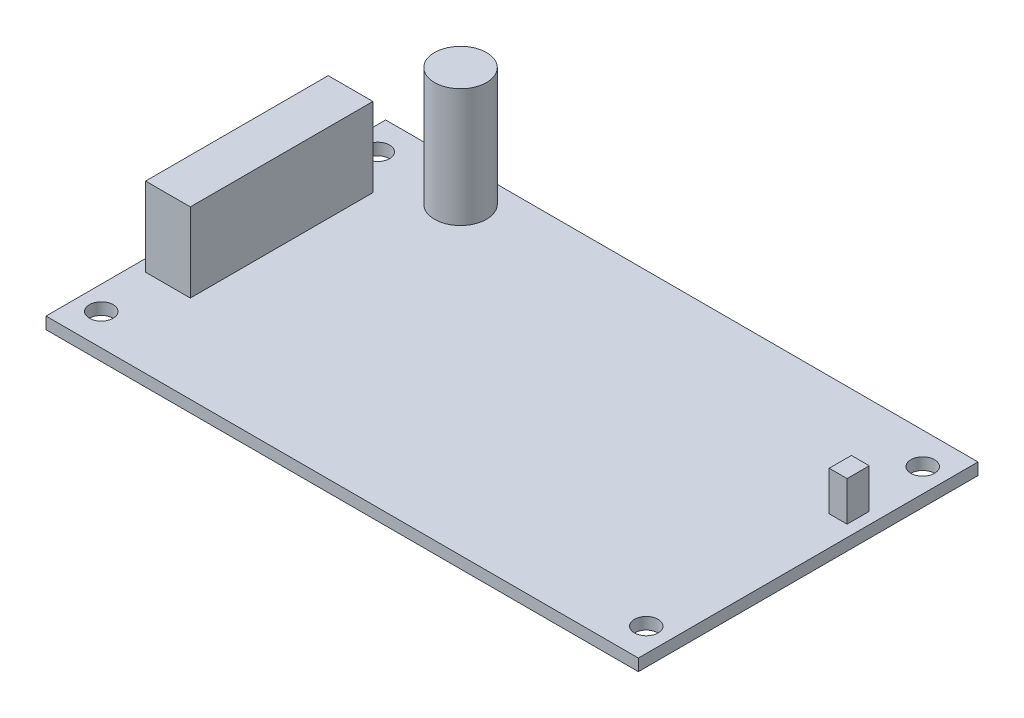
ISO-10303-21;
HEADER;
FILE_DESCRIPTION(('STEP AP214'),'2;1');
FILE_NAME('part.step','',(''),(''),'','','');
FILE_SCHEMA(('AUTOMOTIVE_DESIGN { 1 0 10303 214 1 1 1 1 }'));
ENDSEC;
DATA;
#1=APPLICATION_CONTEXT('core data for automotive mechanical design processes');
#2=APPLICATION_PROTOCOL_DEFINITION('international standard','automotive_design',2000,#1);
#3=PRODUCT_CONTEXT('',#1,'mechanical');
#4=PRODUCT('Part','Part','',(#3));
#5=PRODUCT_RELATED_PRODUCT_CATEGORY('part','',(#4));
#6=PRODUCT_DEFINITION_FORMATION('','',#4);
#7=PRODUCT_DEFINITION_CONTEXT('part definition',#1,'design');
#8=PRODUCT_DEFINITION('design','',#6,#7);
#9=PRODUCT_DEFINITION_SHAPE('','',#8);
#10=(LENGTH_UNIT() NAMED_UNIT(*) SI_UNIT(.MILLI.,.METRE.));
#11=(NAMED_UNIT(*) PLANE_ANGLE_UNIT() SI_UNIT($,.RADIAN.));
#12=(NAMED_UNIT(*) SI_UNIT($,.STERADIAN.) SOLID_ANGLE_UNIT());
#13=UNCERTAINTY_MEASURE_WITH_UNIT(LENGTH_MEASURE(1.E-05),#10,'distance_accuracy_value','');
#14=(GEOMETRIC_REPRESENTATION_CONTEXT(3) GLOBAL_UNCERTAINTY_ASSIGNED_CONTEXT((#13)) GLOBAL_UNIT_ASSIGNED_CONTEXT((#10,
#11,#12)) REPRESENTATION_CONTEXT('',''));
#15=CARTESIAN_POINT('',(0.,0.,0.));
#16=DIRECTION('',(0.,0.,1.));
#17=DIRECTION('',(1.,0.,0.));
#18=AXIS2_PLACEMENT_3D('',#15,#16,#17);
#19=CARTESIAN_POINT('',(0.,1.5,0.));
#20=DIRECTION('',(0.,1.,0.));
#21=DIRECTION('',(0.,0.,1.));
#22=AXIS2_PLACEMENT_3D('',#19,#20,#21);
#23=PLANE('',#22);
#24=CARTESIAN_POINT('',(-23.5051005862928,1.5,-16.9888350772215));
#25=DIRECTION('',(0.,1.,0.));
#26=DIRECTION('',(0.,0.,1.));
#27=AXIS2_PLACEMENT_3D('',#24,#25,#26);
#28=CIRCLE('',#27,3.29212519084606);
#29=CARTESIAN_POINT('',(-23.5051005862928,1.5,-13.6967098863754));
#30=VERTEX_POINT('',#29);
#31=EDGE_CURVE('E392',#30,#30,#28,.T.);
#32=ORIENTED_EDGE('',*,*,#31,.F.);
#33=EDGE_LOOP('',(#32));
#34=FACE_BOUND('',#33,.T.);
#35=CARTESIAN_POINT('',(34.5,1.5,17.5));
#36=DIRECTION('',(0.,1.,0.));
#37=DIRECTION('',(0.,0.,1.));
#38=AXIS2_PLACEMENT_3D('',#35,#36,#37);
#39=CIRCLE('',#38,1.5);
#40=CARTESIAN_POINT('',(34.5,1.5,19.));
#41=VERTEX_POINT('',#40);
#42=EDGE_CURVE('E217',#41,#41,#39,.T.);
#43=ORIENTED_EDGE('',*,*,#42,.F.);
#44=EDGE_LOOP('',(#43));
#45=FACE_BOUND('',#44,.T.);
#46=CARTESIAN_POINT('',(-34.5,1.5,-17.5));
#47=DIRECTION('',(0.,1.,0.));
#48=DIRECTION('',(0.,0.,1.));
#49=AXIS2_PLACEMENT_3D('',#46,#47,#48);
#50=CIRCLE('',#49,1.5);
#51=CARTESIAN_POINT('',(-34.5,1.5,-16.));
#52=VERTEX_POINT('',#51);
#53=EDGE_CURVE('E233',#52,#52,#50,.T.);
#54=ORIENTED_EDGE('',*,*,#53,.F.);
#55=EDGE_LOOP('',(#54));
#56=FACE_BOUND('',#55,.T.);
#57=DIRECTION('',(0.,0.,1.));
#58=VECTOR('',#57,1.);
#59=CARTESIAN_POINT('',(-37.5,1.5,21.5));
#60=LINE('',#59,#58);
#61=CARTESIAN_POINT('',(-37.5,1.5,-21.5));
#62=VERTEX_POINT('',#61);
#63=CARTESIAN_POINT('',(-37.5,1.5,21.5));
#64=VERTEX_POINT('',#63);
#65=EDGE_CURVE('E241',#62,#64,#60,.T.);
#66=ORIENTED_EDGE('',*,*,#65,.T.);
#67=DIRECTION('',(1.,0.,0.));
#68=VECTOR('',#67,1.);
#69=CARTESIAN_POINT('',(37.5,1.5,21.5));
#70=LINE('',#69,#68);
#71=CARTESIAN_POINT('',(37.5,1.5,21.5));
#72=VERTEX_POINT('',#71);
#73=EDGE_CURVE('E245',#64,#72,#70,.T.);
#74=ORIENTED_EDGE('',*,*,#73,.T.);
#75=DIRECTION('',(0.,0.,-1.));
#76=VECTOR('',#75,1.);
#77=CARTESIAN_POINT('',(37.5,1.5,21.5));
#78=LINE('',#77,#76);
#79=CARTESIAN_POINT('',(37.5,1.5,-21.5));
#80=VERTEX_POINT('',#79);
#81=EDGE_CURVE('E249',#72,#80,#78,.T.);
#82=ORIENTED_EDGE('',*,*,#81,.T.);
#83=DIRECTION('',(-1.,0.,0.));
#84=VECTOR('',#83,1.);
#85=CARTESIAN_POINT('',(37.5,1.5,-21.5));
#86=LINE('',#85,#84);
#87=EDGE_CURVE('E252',#80,#62,#86,.T.);
#88=ORIENTED_EDGE('',*,*,#87,.T.);
#89=EDGE_LOOP('',(#66,#74,#82,#88));
#90=FACE_BOUND('',#89,.T.);
#91=CARTESIAN_POINT('',(-34.5,1.5,17.5));
#92=DIRECTION('',(0.,1.,0.));
#93=DIRECTION('',(0.,0.,1.));
#94=AXIS2_PLACEMENT_3D('',#91,#92,#93);
#95=CIRCLE('',#94,1.5);
#96=CARTESIAN_POINT('',(-34.5,1.5,19.));
#97=VERTEX_POINT('',#96);
#98=EDGE_CURVE('E225',#97,#97,#95,.T.);
#99=ORIENTED_EDGE('',*,*,#98,.F.);
#100=EDGE_LOOP('',(#99));
#101=FACE_BOUND('',#100,.T.);
#102=CARTESIAN_POINT('',(34.5,1.5,-17.5));
#103=DIRECTION('',(0.,1.,0.));
#104=DIRECTION('',(0.,0.,1.));
#105=AXIS2_PLACEMENT_3D('',#102,#103,#104);
#106=CIRCLE('',#105,1.5);
#107=CARTESIAN_POINT('',(34.5,1.5,-16.));
#108=VERTEX_POINT('',#107);
#109=EDGE_CURVE('E209',#108,#108,#106,.T.);
#110=ORIENTED_EDGE('',*,*,#109,.F.);
#111=EDGE_LOOP('',(#110));
#112=FACE_BOUND('',#111,.T.);
#113=DIRECTION('',(1.,0.,0.));
#114=VECTOR('',#113,1.);
#115=CARTESIAN_POINT('',(-35.9946094786794,1.5,10.3949949787565));
#116=LINE('',#115,#114);
#117=CARTESIAN_POINT('',(-35.9946094786794,1.5,10.3949949787565));
#118=VERTEX_POINT('',#117);
#119=CARTESIAN_POINT('',(-30.3316644529389,1.5,10.3949949787565));
#120=VERTEX_POINT('',#119);
#121=EDGE_CURVE('E169',#118,#120,#116,.T.);
#122=ORIENTED_EDGE('',*,*,#121,.F.);
#123=DIRECTION('',(0.,0.,1.));
#124=VECTOR('',#123,1.);
#125=CARTESIAN_POINT('',(-35.9946094786794,1.5,-12.7222326605677));
#126=LINE('',#125,#124);
#127=CARTESIAN_POINT('',(-35.9946094786794,1.5,-12.7222326605677));
#128=VERTEX_POINT('',#127);
#129=EDGE_CURVE('E164',#128,#118,#126,.T.);
#130=ORIENTED_EDGE('',*,*,#129,.F.);
#131=DIRECTION('',(-1.,0.,0.));
#132=VECTOR('',#131,1.);
#133=CARTESIAN_POINT('',(-35.9946094786794,1.5,-12.7222326605677));
#134=LINE('',#133,#132);
#135=CARTESIAN_POINT('',(-30.3316644529389,1.5,-12.7222326605677));
#136=VERTEX_POINT('',#135);
#137=EDGE_CURVE('E179',#136,#128,#134,.T.);
#138=ORIENTED_EDGE('',*,*,#137,.F.);
#139=DIRECTION('',(0.,0.,-1.));
#140=VECTOR('',#139,1.);
#141=CARTESIAN_POINT('',(-30.3316644529389,1.5,-12.7222326605677));
#142=LINE('',#141,#140);
#143=EDGE_CURVE('E191',#120,#136,#142,.T.);
#144=ORIENTED_EDGE('',*,*,#143,.F.);
#145=EDGE_LOOP('',(#122,#130,#138,#144));
#146=FACE_BOUND('',#145,.T.);
#147=DIRECTION('',(1.,0.,0.));
#148=VECTOR('',#147,1.);
#149=CARTESIAN_POINT('',(33.7731415433464,1.5,-6.39147098324446));
#150=LINE('',#149,#148);
#151=CARTESIAN_POINT('',(33.7731415433464,1.5,-6.39147098324446));
#152=VERTEX_POINT('',#151);
#153=CARTESIAN_POINT('',(36.0335398179085,1.5,-6.39147098324446));
#154=VERTEX_POINT('',#153);
#155=EDGE_CURVE('E396',#152,#154,#150,.T.);
#156=ORIENTED_EDGE('',*,*,#155,.F.);
#157=DIRECTION('',(0.,0.,1.));
#158=VECTOR('',#157,1.);
#159=CARTESIAN_POINT('',(33.7731415433464,1.5,-9.19748263442496));
#160=LINE('',#159,#158);
#161=CARTESIAN_POINT('',(33.7731415433464,1.5,-9.19748263442496));
#162=VERTEX_POINT('',#161);
#163=EDGE_CURVE('E161',#162,#152,#160,.T.);
#164=ORIENTED_EDGE('',*,*,#163,.F.);
#165=DIRECTION('',(-1.,0.,0.));
#166=VECTOR('',#165,1.);
#167=CARTESIAN_POINT('',(33.7731415433464,1.5,-9.19748263442496));
#168=LINE('',#167,#166);
#169=CARTESIAN_POINT('',(36.0335398179085,1.5,-9.19748263442496));
#170=VERTEX_POINT('',#169);
#171=EDGE_CURVE('E157',#170,#162,#168,.T.);
#172=ORIENTED_EDGE('',*,*,#171,.F.);
#173=DIRECTION('',(0.,0.,-1.));
#174=VECTOR('',#173,1.);
#175=CARTESIAN_POINT('',(36.0335398179085,1.5,-9.19748263442496));
#176=LINE('',#175,#174);
#177=EDGE_CURVE('E408',#154,#170,#176,.T.);
#178=ORIENTED_EDGE('',*,*,#177,.F.);
#179=EDGE_LOOP('',(#156,#164,#172,#178));
#180=FACE_BOUND('',#179,.T.);
#181=ADVANCED_FACE('F45',(#34,#45,#56,#90,#101,#112,#146,#180),#23,.T.);
#182=CARTESIAN_POINT('',(0.,0.,0.));
#183=DIRECTION('',(0.,1.,0.));
#184=DIRECTION('',(0.,0.,1.));
#185=AXIS2_PLACEMENT_3D('',#182,#183,#184);
#186=PLANE('',#185);
#187=DIRECTION('',(0.,0.,1.));
#188=VECTOR('',#187,1.);
#189=CARTESIAN_POINT('',(-37.5,0.,21.5));
#190=LINE('',#189,#188);
#191=CARTESIAN_POINT('',(-37.5,0.,-21.5));
#192=VERTEX_POINT('',#191);
#193=CARTESIAN_POINT('',(-37.5,0.,21.5));
#194=VERTEX_POINT('',#193);
#195=EDGE_CURVE('E237',#192,#194,#190,.T.);
#196=ORIENTED_EDGE('',*,*,#195,.F.);
#197=DIRECTION('',(-1.,0.,0.));
#198=VECTOR('',#197,1.);
#199=CARTESIAN_POINT('',(37.5,0.,-21.5));
#200=LINE('',#199,#198);
#201=CARTESIAN_POINT('',(37.5,0.,-21.5));
#202=VERTEX_POINT('',#201);
#203=EDGE_CURVE('E246',#202,#192,#200,.T.);
#204=ORIENTED_EDGE('',*,*,#203,.F.);
#205=DIRECTION('',(0.,0.,-1.));
#206=VECTOR('',#205,1.);
#207=CARTESIAN_POINT('',(37.5,0.,21.5));
#208=LINE('',#207,#206);
#209=CARTESIAN_POINT('',(37.5,0.,21.5));
#210=VERTEX_POINT('',#209);
#211=EDGE_CURVE('E262',#210,#202,#208,.T.);
#212=ORIENTED_EDGE('',*,*,#211,.F.);
#213=DIRECTION('',(1.,0.,0.));
#214=VECTOR('',#213,1.);
#215=CARTESIAN_POINT('',(37.5,0.,21.5));
#216=LINE('',#215,#214);
#217=EDGE_CURVE('E259',#194,#210,#216,.T.);
#218=ORIENTED_EDGE('',*,*,#217,.F.);
#219=EDGE_LOOP('',(#196,#204,#212,#218));
#220=FACE_BOUND('',#219,.T.);
#221=CARTESIAN_POINT('',(-34.5,0.,-17.5));
#222=DIRECTION('',(0.,1.,0.));
#223=DIRECTION('',(0.,0.,1.));
#224=AXIS2_PLACEMENT_3D('',#221,#222,#223);
#225=CIRCLE('',#224,1.5);
#226=CARTESIAN_POINT('',(-34.5,0.,-16.));
#227=VERTEX_POINT('',#226);
#228=EDGE_CURVE('E229',#227,#227,#225,.T.);
#229=ORIENTED_EDGE('',*,*,#228,.T.);
#230=EDGE_LOOP('',(#229));
#231=FACE_BOUND('',#230,.T.);
#232=CARTESIAN_POINT('',(-34.5,0.,17.5));
#233=DIRECTION('',(0.,1.,0.));
#234=DIRECTION('',(0.,0.,1.));
#235=AXIS2_PLACEMENT_3D('',#232,#233,#234);
#236=CIRCLE('',#235,1.5);
#237=CARTESIAN_POINT('',(-34.5,0.,19.));
#238=VERTEX_POINT('',#237);
#239=EDGE_CURVE('E221',#238,#238,#236,.T.);
#240=ORIENTED_EDGE('',*,*,#239,.T.);
#241=EDGE_LOOP('',(#240));
#242=FACE_BOUND('',#241,.T.);
#243=CARTESIAN_POINT('',(34.5,0.,17.5));
#244=DIRECTION('',(0.,1.,0.));
#245=DIRECTION('',(0.,0.,1.));
#246=AXIS2_PLACEMENT_3D('',#243,#244,#245);
#247=CIRCLE('',#246,1.5);
#248=CARTESIAN_POINT('',(34.5,0.,19.));
#249=VERTEX_POINT('',#248);
#250=EDGE_CURVE('E213',#249,#249,#247,.T.);
#251=ORIENTED_EDGE('',*,*,#250,.T.);
#252=EDGE_LOOP('',(#251));
#253=FACE_BOUND('',#252,.T.);
#254=CARTESIAN_POINT('',(34.5,0.,-17.5));
#255=DIRECTION('',(0.,1.,0.));
#256=DIRECTION('',(0.,0.,1.));
#257=AXIS2_PLACEMENT_3D('',#254,#255,#256);
#258=CIRCLE('',#257,1.5);
#259=CARTESIAN_POINT('',(34.5,0.,-16.));
#260=VERTEX_POINT('',#259);
#261=EDGE_CURVE('E208',#260,#260,#258,.T.);
#262=ORIENTED_EDGE('',*,*,#261,.T.);
#263=EDGE_LOOP('',(#262));
#264=FACE_BOUND('',#263,.T.);
#265=ADVANCED_FACE('F285',(#220,#231,#242,#253,#264),#186,.F.);
#266=CARTESIAN_POINT('',(-37.5,1.5,21.5));
#267=DIRECTION('',(1.,0.,0.));
#268=DIRECTION('',(0.,0.,-1.));
#269=AXIS2_PLACEMENT_3D('',#266,#267,#268);
#270=PLANE('',#269);
#271=ORIENTED_EDGE('',*,*,#195,.T.);
#272=DIRECTION('',(0.,-1.,0.));
#273=VECTOR('',#272,1.);
#274=CARTESIAN_POINT('',(-37.5,1.5,21.5));
#275=LINE('',#274,#273);
#276=EDGE_CURVE('E11',#64,#194,#275,.T.);
#277=ORIENTED_EDGE('',*,*,#276,.F.);
#278=ORIENTED_EDGE('',*,*,#65,.F.);
#279=DIRECTION('',(0.,-1.,0.));
#280=VECTOR('',#279,1.);
#281=CARTESIAN_POINT('',(-37.5,1.5,-21.5));
#282=LINE('',#281,#280);
#283=EDGE_CURVE('E255',#62,#192,#282,.T.);
#284=ORIENTED_EDGE('',*,*,#283,.T.);
#285=EDGE_LOOP('',(#271,#277,#278,#284));
#286=FACE_BOUND('',#285,.T.);
#287=ADVANCED_FACE('F47',(#286),#270,.F.);
#288=CARTESIAN_POINT('',(37.5,1.5,21.5));
#289=DIRECTION('',(0.,0.,-1.));
#290=DIRECTION('',(-1.,0.,0.));
#291=AXIS2_PLACEMENT_3D('',#288,#289,#290);
#292=PLANE('',#291);
#293=ORIENTED_EDGE('',*,*,#217,.T.);
#294=DIRECTION('',(0.,-1.,0.));
#295=VECTOR('',#294,1.);
#296=CARTESIAN_POINT('',(37.5,1.5,21.5));
#297=LINE('',#296,#295);
#298=EDGE_CURVE('E54',#72,#210,#297,.T.);
#299=ORIENTED_EDGE('',*,*,#298,.F.);
#300=ORIENTED_EDGE('',*,*,#73,.F.);
#301=ORIENTED_EDGE('',*,*,#276,.T.);
#302=EDGE_LOOP('',(#293,#299,#300,#301));
#303=FACE_BOUND('',#302,.T.);
#304=ADVANCED_FACE('F296',(#303),#292,.F.);
#305=CARTESIAN_POINT('',(37.5,1.5,21.5));
#306=DIRECTION('',(-1.,0.,0.));
#307=DIRECTION('',(0.,0.,1.));
#308=AXIS2_PLACEMENT_3D('',#305,#306,#307);
#309=PLANE('',#308);
#310=ORIENTED_EDGE('',*,*,#211,.T.);
#311=DIRECTION('',(0.,-1.,0.));
#312=VECTOR('',#311,1.);
#313=CARTESIAN_POINT('',(37.5,1.5,-21.5));
#314=LINE('',#313,#312);
#315=EDGE_CURVE('E270',#80,#202,#314,.T.);
#316=ORIENTED_EDGE('',*,*,#315,.F.);
#317=ORIENTED_EDGE('',*,*,#81,.F.);
#318=ORIENTED_EDGE('',*,*,#298,.T.);
#319=EDGE_LOOP('',(#310,#316,#317,#318));
#320=FACE_BOUND('',#319,.T.);
#321=ADVANCED_FACE('F279',(#320),#309,.F.);
#322=CARTESIAN_POINT('',(37.5,1.5,-21.5));
#323=DIRECTION('',(0.,0.,1.));
#324=DIRECTION('',(1.,0.,0.));
#325=AXIS2_PLACEMENT_3D('',#322,#323,#324);
#326=PLANE('',#325);
#327=ORIENTED_EDGE('',*,*,#203,.T.);
#328=ORIENTED_EDGE('',*,*,#283,.F.);
#329=ORIENTED_EDGE('',*,*,#87,.F.);
#330=ORIENTED_EDGE('',*,*,#315,.T.);
#331=EDGE_LOOP('',(#327,#328,#329,#330));
#332=FACE_BOUND('',#331,.T.);
#333=ADVANCED_FACE('F289',(#332),#326,.F.);
#334=CARTESIAN_POINT('',(-34.5,1.5,-17.5));
#335=DIRECTION('',(0.,-1.,0.));
#336=DIRECTION('',(0.,0.,-1.));
#337=AXIS2_PLACEMENT_3D('',#334,#335,#336);
#338=CYLINDRICAL_SURFACE('',#337,1.5);
#339=ORIENTED_EDGE('',*,*,#53,.T.);
#340=EDGE_LOOP('',(#339));
#341=FACE_BOUND('',#340,.T.);
#342=ORIENTED_EDGE('',*,*,#228,.F.);
#343=EDGE_LOOP('',(#342));
#344=FACE_BOUND('',#343,.T.);
#345=ADVANCED_FACE('F315',(#341,#344),#338,.F.);
#346=CARTESIAN_POINT('',(-34.5,1.5,17.5));
#347=DIRECTION('',(0.,-1.,0.));
#348=DIRECTION('',(0.,0.,-1.));
#349=AXIS2_PLACEMENT_3D('',#346,#347,#348);
#350=CYLINDRICAL_SURFACE('',#349,1.5);
#351=ORIENTED_EDGE('',*,*,#98,.T.);
#352=EDGE_LOOP('',(#351));
#353=FACE_BOUND('',#352,.T.);
#354=ORIENTED_EDGE('',*,*,#239,.F.);
#355=EDGE_LOOP('',(#354));
#356=FACE_BOUND('',#355,.T.);
#357=ADVANCED_FACE('F322',(#353,#356),#350,.F.);
#358=CARTESIAN_POINT('',(34.5,1.5,17.5));
#359=DIRECTION('',(0.,-1.,0.));
#360=DIRECTION('',(0.,0.,-1.));
#361=AXIS2_PLACEMENT_3D('',#358,#359,#360);
#362=CYLINDRICAL_SURFACE('',#361,1.5);
#363=ORIENTED_EDGE('',*,*,#42,.T.);
#364=EDGE_LOOP('',(#363));
#365=FACE_BOUND('',#364,.T.);
#366=ORIENTED_EDGE('',*,*,#250,.F.);
#367=EDGE_LOOP('',(#366));
#368=FACE_BOUND('',#367,.T.);
#369=ADVANCED_FACE('F327',(#365,#368),#362,.F.);
#370=CARTESIAN_POINT('',(34.5,1.5,-17.5));
#371=DIRECTION('',(0.,-1.,0.));
#372=DIRECTION('',(0.,0.,-1.));
#373=AXIS2_PLACEMENT_3D('',#370,#371,#372);
#374=CYLINDRICAL_SURFACE('',#373,1.5);
#375=ORIENTED_EDGE('',*,*,#109,.T.);
#376=EDGE_LOOP('',(#375));
#377=FACE_BOUND('',#376,.T.);
#378=ORIENTED_EDGE('',*,*,#261,.F.);
#379=EDGE_LOOP('',(#378));
#380=FACE_BOUND('',#379,.T.);
#381=ADVANCED_FACE('F339',(#377,#380),#374,.F.);
#382=CARTESIAN_POINT('',(-35.9946094786794,11.5,-12.7222326605677));
#383=DIRECTION('',(1.,0.,0.));
#384=DIRECTION('',(0.,0.,-1.));
#385=AXIS2_PLACEMENT_3D('',#382,#383,#384);
#386=PLANE('',#385);
#387=ORIENTED_EDGE('',*,*,#129,.T.);
#388=DIRECTION('',(0.,-1.,0.));
#389=VECTOR('',#388,1.);
#390=CARTESIAN_POINT('',(-35.9946094786794,11.5,10.3949949787565));
#391=LINE('',#390,#389);
#392=CARTESIAN_POINT('',(-35.9946094786794,11.5,10.3949949787565));
#393=VERTEX_POINT('',#392);
#394=EDGE_CURVE('E205',#393,#118,#391,.T.);
#395=ORIENTED_EDGE('',*,*,#394,.F.);
#396=DIRECTION('',(0.,0.,1.));
#397=VECTOR('',#396,1.);
#398=CARTESIAN_POINT('',(-35.9946094786794,11.5,-12.7222326605677));
#399=LINE('',#398,#397);
#400=CARTESIAN_POINT('',(-35.9946094786794,11.5,-12.7222326605677));
#401=VERTEX_POINT('',#400);
#402=EDGE_CURVE('E174',#401,#393,#399,.T.);
#403=ORIENTED_EDGE('',*,*,#402,.F.);
#404=DIRECTION('',(0.,-1.,0.));
#405=VECTOR('',#404,1.);
#406=CARTESIAN_POINT('',(-35.9946094786794,11.5,-12.7222326605677));
#407=LINE('',#406,#405);
#408=EDGE_CURVE('E187',#401,#128,#407,.T.);
#409=ORIENTED_EDGE('',*,*,#408,.T.);
#410=EDGE_LOOP('',(#387,#395,#403,#409));
#411=FACE_BOUND('',#410,.T.);
#412=ADVANCED_FACE('F341',(#411),#386,.F.);
#413=CARTESIAN_POINT('',(-35.9946094786794,11.5,10.3949949787565));
#414=DIRECTION('',(0.,0.,-1.));
#415=DIRECTION('',(-1.,0.,0.));
#416=AXIS2_PLACEMENT_3D('',#413,#414,#415);
#417=PLANE('',#416);
#418=ORIENTED_EDGE('',*,*,#121,.T.);
#419=DIRECTION('',(0.,-1.,0.));
#420=VECTOR('',#419,1.);
#421=CARTESIAN_POINT('',(-30.3316644529389,11.5,10.3949949787565));
#422=LINE('',#421,#420);
#423=CARTESIAN_POINT('',(-30.3316644529389,11.5,10.3949949787565));
#424=VERTEX_POINT('',#423);
#425=EDGE_CURVE('E201',#424,#120,#422,.T.);
#426=ORIENTED_EDGE('',*,*,#425,.F.);
#427=DIRECTION('',(1.,0.,0.));
#428=VECTOR('',#427,1.);
#429=CARTESIAN_POINT('',(-35.9946094786794,11.5,10.3949949787565));
#430=LINE('',#429,#428);
#431=EDGE_CURVE('E178',#393,#424,#430,.T.);
#432=ORIENTED_EDGE('',*,*,#431,.F.);
#433=ORIENTED_EDGE('',*,*,#394,.T.);
#434=EDGE_LOOP('',(#418,#426,#432,#433));
#435=FACE_BOUND('',#434,.T.);
#436=ADVANCED_FACE('F348',(#435),#417,.F.);
#437=CARTESIAN_POINT('',(-30.3316644529389,11.5,-12.7222326605677));
#438=DIRECTION('',(-1.,0.,0.));
#439=DIRECTION('',(0.,0.,1.));
#440=AXIS2_PLACEMENT_3D('',#437,#438,#439);
#441=PLANE('',#440);
#442=ORIENTED_EDGE('',*,*,#143,.T.);
#443=DIRECTION('',(0.,-1.,0.));
#444=VECTOR('',#443,1.);
#445=CARTESIAN_POINT('',(-30.3316644529389,11.5,-12.7222326605677));
#446=LINE('',#445,#444);
#447=CARTESIAN_POINT('',(-30.3316644529389,11.5,-12.7222326605677));
#448=VERTEX_POINT('',#447);
#449=EDGE_CURVE('E69',#448,#136,#446,.T.);
#450=ORIENTED_EDGE('',*,*,#449,.F.);
#451=DIRECTION('',(0.,0.,-1.));
#452=VECTOR('',#451,1.);
#453=CARTESIAN_POINT('',(-30.3316644529389,11.5,-12.7222326605677));
#454=LINE('',#453,#452);
#455=EDGE_CURVE('E182',#424,#448,#454,.T.);
#456=ORIENTED_EDGE('',*,*,#455,.F.);
#457=ORIENTED_EDGE('',*,*,#425,.T.);
#458=EDGE_LOOP('',(#442,#450,#456,#457));
#459=FACE_BOUND('',#458,.T.);
#460=ADVANCED_FACE('F356',(#459),#441,.F.);
#461=CARTESIAN_POINT('',(-35.9946094786794,11.5,-12.7222326605677));
#462=DIRECTION('',(0.,0.,1.));
#463=DIRECTION('',(1.,0.,0.));
#464=AXIS2_PLACEMENT_3D('',#461,#462,#463);
#465=PLANE('',#464);
#466=ORIENTED_EDGE('',*,*,#137,.T.);
#467=ORIENTED_EDGE('',*,*,#408,.F.);
#468=DIRECTION('',(-1.,0.,0.));
#469=VECTOR('',#468,1.);
#470=CARTESIAN_POINT('',(-35.9946094786794,11.5,-12.7222326605677));
#471=LINE('',#470,#469);
#472=EDGE_CURVE('E185',#448,#401,#471,.T.);
#473=ORIENTED_EDGE('',*,*,#472,.F.);
#474=ORIENTED_EDGE('',*,*,#449,.T.);
#475=EDGE_LOOP('',(#466,#467,#473,#474));
#476=FACE_BOUND('',#475,.T.);
#477=ADVANCED_FACE('F360',(#476),#465,.F.);
#478=CARTESIAN_POINT('',(0.,11.5,0.));
#479=DIRECTION('',(0.,1.,0.));
#480=DIRECTION('',(0.,0.,1.));
#481=AXIS2_PLACEMENT_3D('',#478,#479,#480);
#482=PLANE('',#481);
#483=ORIENTED_EDGE('',*,*,#402,.T.);
#484=ORIENTED_EDGE('',*,*,#431,.T.);
#485=ORIENTED_EDGE('',*,*,#455,.T.);
#486=ORIENTED_EDGE('',*,*,#472,.T.);
#487=EDGE_LOOP('',(#483,#484,#485,#486));
#488=FACE_BOUND('',#487,.T.);
#489=ADVANCED_FACE('F364',(#488),#482,.T.);
#490=CARTESIAN_POINT('',(33.7731415433464,6.5,-9.19748263442496));
#491=DIRECTION('',(1.,0.,0.));
#492=DIRECTION('',(0.,0.,-1.));
#493=AXIS2_PLACEMENT_3D('',#490,#491,#492);
#494=PLANE('',#493);
#495=ORIENTED_EDGE('',*,*,#163,.T.);
#496=DIRECTION('',(0.,-1.,0.));
#497=VECTOR('',#496,1.);
#498=CARTESIAN_POINT('',(33.7731415433464,6.5,-6.39147098324446));
#499=LINE('',#498,#497);
#500=CARTESIAN_POINT('',(33.7731415433464,6.5,-6.39147098324446));
#501=VERTEX_POINT('',#500);
#502=EDGE_CURVE('E140',#501,#152,#499,.T.);
#503=ORIENTED_EDGE('',*,*,#502,.F.);
#504=DIRECTION('',(0.,0.,1.));
#505=VECTOR('',#504,1.);
#506=CARTESIAN_POINT('',(33.7731415433464,6.5,-9.19748263442496));
#507=LINE('',#506,#505);
#508=CARTESIAN_POINT('',(33.7731415433464,6.5,-9.19748263442496));
#509=VERTEX_POINT('',#508);
#510=EDGE_CURVE('E148',#509,#501,#507,.T.);
#511=ORIENTED_EDGE('',*,*,#510,.F.);
#512=DIRECTION('',(0.,-1.,0.));
#513=VECTOR('',#512,1.);
#514=CARTESIAN_POINT('',(33.7731415433464,6.5,-9.19748263442496));
#515=LINE('',#514,#513);
#516=EDGE_CURVE('E404',#509,#162,#515,.T.);
#517=ORIENTED_EDGE('',*,*,#516,.T.);
#518=EDGE_LOOP('',(#495,#503,#511,#517));
#519=FACE_BOUND('',#518,.T.);
#520=ADVANCED_FACE('F159',(#519),#494,.F.);
#521=CARTESIAN_POINT('',(33.7731415433464,6.5,-6.39147098324446));
#522=DIRECTION('',(0.,0.,-1.));
#523=DIRECTION('',(-1.,0.,0.));
#524=AXIS2_PLACEMENT_3D('',#521,#522,#523);
#525=PLANE('',#524);
#526=ORIENTED_EDGE('',*,*,#155,.T.);
#527=DIRECTION('',(0.,-1.,0.));
#528=VECTOR('',#527,1.);
#529=CARTESIAN_POINT('',(36.0335398179085,6.5,-6.39147098324446));
#530=LINE('',#529,#528);
#531=CARTESIAN_POINT('',(36.0335398179085,6.5,-6.39147098324446));
#532=VERTEX_POINT('',#531);
#533=EDGE_CURVE('E143',#532,#154,#530,.T.);
#534=ORIENTED_EDGE('',*,*,#533,.F.);
#535=DIRECTION('',(1.,0.,0.));
#536=VECTOR('',#535,1.);
#537=CARTESIAN_POINT('',(33.7731415433464,6.5,-6.39147098324446));
#538=LINE('',#537,#536);
#539=EDGE_CURVE('E136',#501,#532,#538,.T.);
#540=ORIENTED_EDGE('',*,*,#539,.F.);
#541=ORIENTED_EDGE('',*,*,#502,.T.);
#542=EDGE_LOOP('',(#526,#534,#540,#541));
#543=FACE_BOUND('',#542,.T.);
#544=ADVANCED_FACE('F138',(#543),#525,.F.);
#545=CARTESIAN_POINT('',(36.0335398179085,6.5,-9.19748263442496));
#546=DIRECTION('',(-1.,0.,0.));
#547=DIRECTION('',(0.,0.,1.));
#548=AXIS2_PLACEMENT_3D('',#545,#546,#547);
#549=PLANE('',#548);
#550=ORIENTED_EDGE('',*,*,#177,.T.);
#551=DIRECTION('',(0.,-1.,0.));
#552=VECTOR('',#551,1.);
#553=CARTESIAN_POINT('',(36.0335398179085,6.5,-9.19748263442496));
#554=LINE('',#553,#552);
#555=CARTESIAN_POINT('',(36.0335398179085,6.5,-9.19748263442496));
#556=VERTEX_POINT('',#555);
#557=EDGE_CURVE('E61',#556,#170,#554,.T.);
#558=ORIENTED_EDGE('',*,*,#557,.F.);
#559=DIRECTION('',(0.,0.,-1.));
#560=VECTOR('',#559,1.);
#561=CARTESIAN_POINT('',(36.0335398179085,6.5,-9.19748263442496));
#562=LINE('',#561,#560);
#563=EDGE_CURVE('E147',#532,#556,#562,.T.);
#564=ORIENTED_EDGE('',*,*,#563,.F.);
#565=ORIENTED_EDGE('',*,*,#533,.T.);
#566=EDGE_LOOP('',(#550,#558,#564,#565));
#567=FACE_BOUND('',#566,.T.);
#568=ADVANCED_FACE('F372',(#567),#549,.F.);
#569=CARTESIAN_POINT('',(33.7731415433464,6.5,-9.19748263442496));
#570=DIRECTION('',(0.,0.,1.));
#571=DIRECTION('',(1.,0.,0.));
#572=AXIS2_PLACEMENT_3D('',#569,#570,#571);
#573=PLANE('',#572);
#574=ORIENTED_EDGE('',*,*,#171,.T.);
#575=ORIENTED_EDGE('',*,*,#516,.F.);
#576=DIRECTION('',(-1.,0.,0.));
#577=VECTOR('',#576,1.);
#578=CARTESIAN_POINT('',(33.7731415433464,6.5,-9.19748263442496));
#579=LINE('',#578,#577);
#580=EDGE_CURVE('E152',#556,#509,#579,.T.);
#581=ORIENTED_EDGE('',*,*,#580,.F.);
#582=ORIENTED_EDGE('',*,*,#557,.T.);
#583=EDGE_LOOP('',(#574,#575,#581,#582));
#584=FACE_BOUND('',#583,.T.);
#585=ADVANCED_FACE('F375',(#584),#573,.F.);
#586=CARTESIAN_POINT('',(0.,6.5,0.));
#587=DIRECTION('',(0.,1.,0.));
#588=DIRECTION('',(0.,0.,1.));
#589=AXIS2_PLACEMENT_3D('',#586,#587,#588);
#590=PLANE('',#589);
#591=ORIENTED_EDGE('',*,*,#510,.T.);
#592=ORIENTED_EDGE('',*,*,#539,.T.);
#593=ORIENTED_EDGE('',*,*,#563,.T.);
#594=ORIENTED_EDGE('',*,*,#580,.T.);
#595=EDGE_LOOP('',(#591,#592,#593,#594));
#596=FACE_BOUND('',#595,.T.);
#597=ADVANCED_FACE('F151',(#596),#590,.T.);
#598=CARTESIAN_POINT('',(-23.5051005862928,16.5,-16.9888350772215));
#599=DIRECTION('',(0.,-1.,0.));
#600=DIRECTION('',(0.,0.,-1.));
#601=AXIS2_PLACEMENT_3D('',#598,#599,#600);
#602=CYLINDRICAL_SURFACE('',#601,3.29212519084606);
#603=CARTESIAN_POINT('',(-23.5051005862928,16.5,-16.9888350772215));
#604=DIRECTION('',(0.,1.,0.));
#605=DIRECTION('',(0.,0.,1.));
#606=AXIS2_PLACEMENT_3D('',#603,#604,#605);
#607=CIRCLE('',#606,3.29212519084606);
#608=CARTESIAN_POINT('',(-23.5051005862928,16.5,-13.6967098863754));
#609=VERTEX_POINT('',#608);
#610=EDGE_CURVE('E390',#609,#609,#607,.T.);
#611=ORIENTED_EDGE('',*,*,#610,.F.);
#612=EDGE_LOOP('',(#611));
#613=FACE_BOUND('',#612,.T.);
#614=ORIENTED_EDGE('',*,*,#31,.T.);
#615=EDGE_LOOP('',(#614));
#616=FACE_BOUND('',#615,.T.);
#617=ADVANCED_FACE('F380',(#613,#616),#602,.T.);
#618=CARTESIAN_POINT('',(-23.5051005862928,16.5,-16.9888350772215));
#619=DIRECTION('',(0.,1.,0.));
#620=DIRECTION('',(0.,0.,1.));
#621=AXIS2_PLACEMENT_3D('',#618,#619,#620);
#622=PLANE('',#621);
#623=ORIENTED_EDGE('',*,*,#610,.T.);
#624=EDGE_LOOP('',(#623));
#625=FACE_BOUND('',#624,.T.);
#626=ADVANCED_FACE('F382',(#625),#622,.T.);
#627=CLOSED_SHELL('',(#181,#265,#287,#304,#321,#333,#345,#357,#369,#381,#412,#436,#460,#477,
#489,#520,#544,#568,#585,#597,#617,#626));
#628=MANIFOLD_SOLID_BREP('B2',#627);
#629=ADVANCED_BREP_SHAPE_REPRESENTATION('',(#18,#628),#14);
#630=SHAPE_DEFINITION_REPRESENTATION(#9,#629);
ENDSEC;
END-ISO-10303-21;
